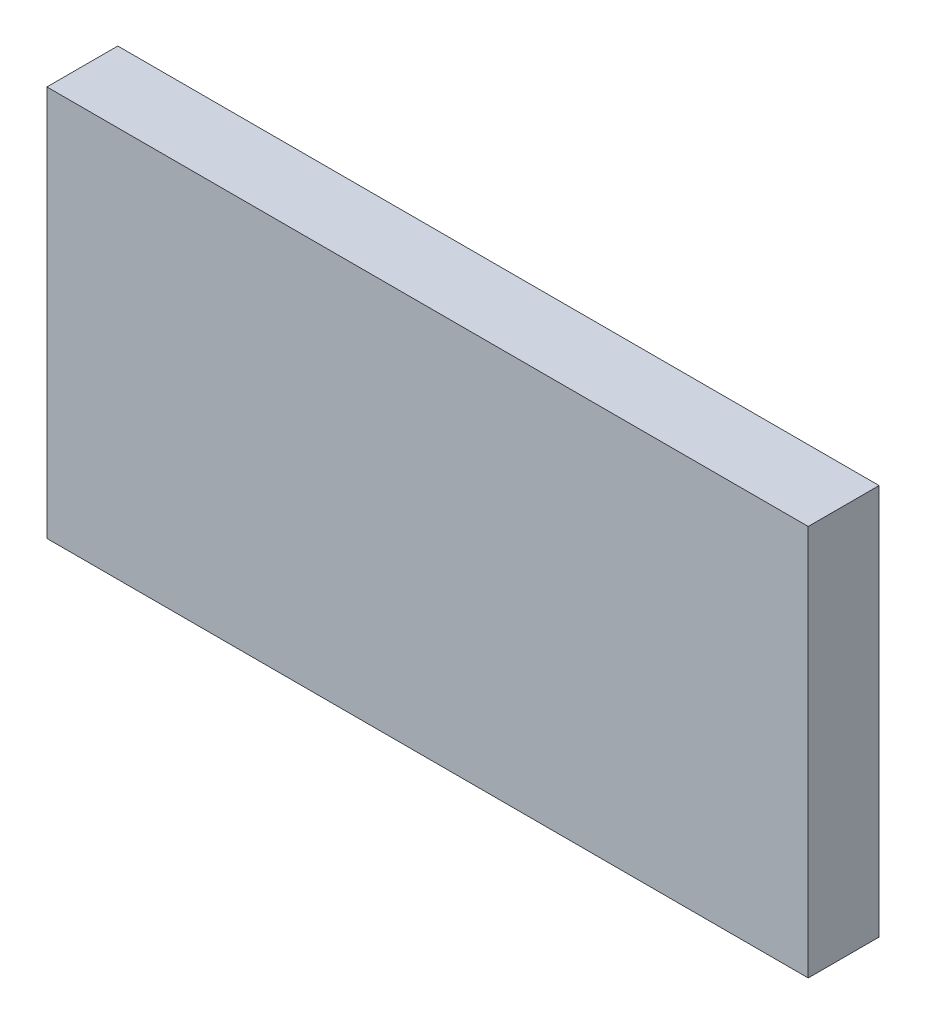
ISO-10303-21;
HEADER;
FILE_DESCRIPTION(('STEP AP214'),'2;1');
FILE_NAME('part.step','',(''),(''),'','','');
FILE_SCHEMA(('AUTOMOTIVE_DESIGN { 1 0 10303 214 1 1 1 1 }'));
ENDSEC;
DATA;
#1=APPLICATION_CONTEXT('core data for automotive mechanical design processes');
#2=APPLICATION_PROTOCOL_DEFINITION('international standard','automotive_design',2000,#1);
#3=PRODUCT_CONTEXT('',#1,'mechanical');
#4=PRODUCT('Part','Part','',(#3));
#5=PRODUCT_RELATED_PRODUCT_CATEGORY('part','',(#4));
#6=PRODUCT_DEFINITION_FORMATION('','',#4);
#7=PRODUCT_DEFINITION_CONTEXT('part definition',#1,'design');
#8=PRODUCT_DEFINITION('design','',#6,#7);
#9=PRODUCT_DEFINITION_SHAPE('','',#8);
#10=(LENGTH_UNIT() NAMED_UNIT(*) SI_UNIT(.MILLI.,.METRE.));
#11=(NAMED_UNIT(*) PLANE_ANGLE_UNIT() SI_UNIT($,.RADIAN.));
#12=(NAMED_UNIT(*) SI_UNIT($,.STERADIAN.) SOLID_ANGLE_UNIT());
#13=UNCERTAINTY_MEASURE_WITH_UNIT(LENGTH_MEASURE(1.E-05),#10,'distance_accuracy_value','');
#14=(GEOMETRIC_REPRESENTATION_CONTEXT(3) GLOBAL_UNCERTAINTY_ASSIGNED_CONTEXT((#13)) GLOBAL_UNIT_ASSIGNED_CONTEXT((#10,
#11,#12)) REPRESENTATION_CONTEXT('',''));
#15=CARTESIAN_POINT('',(0.,0.,0.));
#16=DIRECTION('',(0.,0.,1.));
#17=DIRECTION('',(1.,0.,0.));
#18=AXIS2_PLACEMENT_3D('',#15,#16,#17);
#19=CARTESIAN_POINT('',(0.,0.,0.615));
#20=DIRECTION('',(0.,0.,-1.));
#21=DIRECTION('',(-1.,0.,0.));
#22=AXIS2_PLACEMENT_3D('',#19,#20,#21);
#23=PLANE('',#22);
#24=DIRECTION('',(1.,0.,0.));
#25=VECTOR('',#24,1.);
#26=CARTESIAN_POINT('',(3.115,-1.6,0.615));
#27=LINE('',#26,#25);
#28=CARTESIAN_POINT('',(3.115,-1.6,0.615));
#29=VERTEX_POINT('',#28);
#30=CARTESIAN_POINT('',(-3.115,-1.6,0.615));
#31=VERTEX_POINT('',#30);
#32=EDGE_CURVE('E68',#29,#31,#27,.F.);
#33=ORIENTED_EDGE('',*,*,#32,.F.);
#34=DIRECTION('',(0.,1.,0.));
#35=VECTOR('',#34,1.);
#36=CARTESIAN_POINT('',(3.115,1.6,0.615));
#37=LINE('',#36,#35);
#38=CARTESIAN_POINT('',(3.115,1.6,0.615));
#39=VERTEX_POINT('',#38);
#40=EDGE_CURVE('E55',#39,#29,#37,.F.);
#41=ORIENTED_EDGE('',*,*,#40,.F.);
#42=DIRECTION('',(1.,0.,0.));
#43=VECTOR('',#42,1.);
#44=CARTESIAN_POINT('',(-3.115,1.6,0.615));
#45=LINE('',#44,#43);
#46=CARTESIAN_POINT('',(-3.115,1.6,0.615));
#47=VERTEX_POINT('',#46);
#48=EDGE_CURVE('E20',#47,#39,#45,.T.);
#49=ORIENTED_EDGE('',*,*,#48,.F.);
#50=DIRECTION('',(0.,1.,0.));
#51=VECTOR('',#50,1.);
#52=CARTESIAN_POINT('',(-3.115,-1.6,0.615));
#53=LINE('',#52,#51);
#54=EDGE_CURVE('E80',#31,#47,#53,.T.);
#55=ORIENTED_EDGE('',*,*,#54,.F.);
#56=EDGE_LOOP('',(#33,#41,#49,#55));
#57=FACE_BOUND('',#56,.T.);
#58=ADVANCED_FACE('F17',(#57),#23,.F.);
#59=CARTESIAN_POINT('',(-3.115,1.6,0.035));
#60=DIRECTION('',(0.,1.,0.));
#61=DIRECTION('',(0.,0.,1.));
#62=AXIS2_PLACEMENT_3D('',#59,#60,#61);
#63=PLANE('',#62);
#64=DIRECTION('',(0.,0.,-1.));
#65=VECTOR('',#64,1.);
#66=CARTESIAN_POINT('',(3.115,1.6,0.035));
#67=LINE('',#66,#65);
#68=CARTESIAN_POINT('',(3.115,1.6,0.035));
#69=VERTEX_POINT('',#68);
#70=EDGE_CURVE('E61',#69,#39,#67,.F.);
#71=ORIENTED_EDGE('',*,*,#70,.F.);
#72=DIRECTION('',(-1.,0.,0.));
#73=VECTOR('',#72,1.);
#74=CARTESIAN_POINT('',(0.,1.6,0.035));
#75=LINE('',#74,#73);
#76=CARTESIAN_POINT('',(-3.115,1.6,0.035));
#77=VERTEX_POINT('',#76);
#78=EDGE_CURVE('E83',#77,#69,#75,.F.);
#79=ORIENTED_EDGE('',*,*,#78,.F.);
#80=DIRECTION('',(0.,0.,1.));
#81=VECTOR('',#80,1.);
#82=CARTESIAN_POINT('',(-3.115,1.6,0.035));
#83=LINE('',#82,#81);
#84=EDGE_CURVE('E64',#47,#77,#83,.F.);
#85=ORIENTED_EDGE('',*,*,#84,.F.);
#86=ORIENTED_EDGE('',*,*,#48,.T.);
#87=EDGE_LOOP('',(#71,#79,#85,#86));
#88=FACE_BOUND('',#87,.T.);
#89=ADVANCED_FACE('F60',(#88),#63,.T.);
#90=CARTESIAN_POINT('',(3.115,1.6,0.035));
#91=DIRECTION('',(1.,0.,0.));
#92=DIRECTION('',(0.,0.,-1.));
#93=AXIS2_PLACEMENT_3D('',#90,#91,#92);
#94=PLANE('',#93);
#95=DIRECTION('',(0.,0.,-1.));
#96=VECTOR('',#95,1.);
#97=CARTESIAN_POINT('',(3.115,-1.6,0.035));
#98=LINE('',#97,#96);
#99=CARTESIAN_POINT('',(3.115,-1.6,0.035));
#100=VERTEX_POINT('',#99);
#101=EDGE_CURVE('E70',#100,#29,#98,.F.);
#102=ORIENTED_EDGE('',*,*,#101,.F.);
#103=DIRECTION('',(0.,1.,0.));
#104=VECTOR('',#103,1.);
#105=CARTESIAN_POINT('',(3.115,0.,0.035));
#106=LINE('',#105,#104);
#107=EDGE_CURVE('E74',#69,#100,#106,.F.);
#108=ORIENTED_EDGE('',*,*,#107,.F.);
#109=ORIENTED_EDGE('',*,*,#70,.T.);
#110=ORIENTED_EDGE('',*,*,#40,.T.);
#111=EDGE_LOOP('',(#102,#108,#109,#110));
#112=FACE_BOUND('',#111,.T.);
#113=ADVANCED_FACE('F72',(#112),#94,.T.);
#114=CARTESIAN_POINT('',(3.115,-1.6,0.035));
#115=DIRECTION('',(0.,-1.,0.));
#116=DIRECTION('',(0.,0.,-1.));
#117=AXIS2_PLACEMENT_3D('',#114,#115,#116);
#118=PLANE('',#117);
#119=DIRECTION('',(0.,0.,1.));
#120=VECTOR('',#119,1.);
#121=CARTESIAN_POINT('',(-3.115,-1.6,0.035));
#122=LINE('',#121,#120);
#123=CARTESIAN_POINT('',(-3.115,-1.6,0.035));
#124=VERTEX_POINT('',#123);
#125=EDGE_CURVE('E35',#124,#31,#122,.T.);
#126=ORIENTED_EDGE('',*,*,#125,.F.);
#127=DIRECTION('',(-1.,0.,0.));
#128=VECTOR('',#127,1.);
#129=CARTESIAN_POINT('',(0.,-1.6,0.035));
#130=LINE('',#129,#128);
#131=EDGE_CURVE('E26',#100,#124,#130,.T.);
#132=ORIENTED_EDGE('',*,*,#131,.F.);
#133=ORIENTED_EDGE('',*,*,#101,.T.);
#134=ORIENTED_EDGE('',*,*,#32,.T.);
#135=EDGE_LOOP('',(#126,#132,#133,#134));
#136=FACE_BOUND('',#135,.T.);
#137=ADVANCED_FACE('F89',(#136),#118,.T.);
#138=CARTESIAN_POINT('',(-3.115,-1.6,0.035));
#139=DIRECTION('',(-1.,0.,0.));
#140=DIRECTION('',(0.,0.,1.));
#141=AXIS2_PLACEMENT_3D('',#138,#139,#140);
#142=PLANE('',#141);
#143=ORIENTED_EDGE('',*,*,#84,.T.);
#144=DIRECTION('',(0.,1.,0.));
#145=VECTOR('',#144,1.);
#146=CARTESIAN_POINT('',(-3.115,0.,0.035));
#147=LINE('',#146,#145);
#148=EDGE_CURVE('E11',#124,#77,#147,.T.);
#149=ORIENTED_EDGE('',*,*,#148,.F.);
#150=ORIENTED_EDGE('',*,*,#125,.T.);
#151=ORIENTED_EDGE('',*,*,#54,.T.);
#152=EDGE_LOOP('',(#143,#149,#150,#151));
#153=FACE_BOUND('',#152,.T.);
#154=ADVANCED_FACE('F91',(#153),#142,.T.);
#155=CARTESIAN_POINT('',(0.,0.,0.035));
#156=DIRECTION('',(0.,0.,-1.));
#157=DIRECTION('',(-1.,0.,0.));
#158=AXIS2_PLACEMENT_3D('',#155,#156,#157);
#159=PLANE('',#158);
#160=ORIENTED_EDGE('',*,*,#131,.T.);
#161=ORIENTED_EDGE('',*,*,#148,.T.);
#162=ORIENTED_EDGE('',*,*,#78,.T.);
#163=ORIENTED_EDGE('',*,*,#107,.T.);
#164=EDGE_LOOP('',(#160,#161,#162,#163));
#165=FACE_BOUND('',#164,.T.);
#166=ADVANCED_FACE('F88',(#165),#159,.T.);
#167=CLOSED_SHELL('',(#58,#89,#113,#137,#154,#166));
#168=MANIFOLD_SOLID_BREP('B1',#167);
#169=ADVANCED_BREP_SHAPE_REPRESENTATION('',(#18,#168),#14);
#170=SHAPE_DEFINITION_REPRESENTATION(#9,#169);
ENDSEC;
END-ISO-10303-21;
